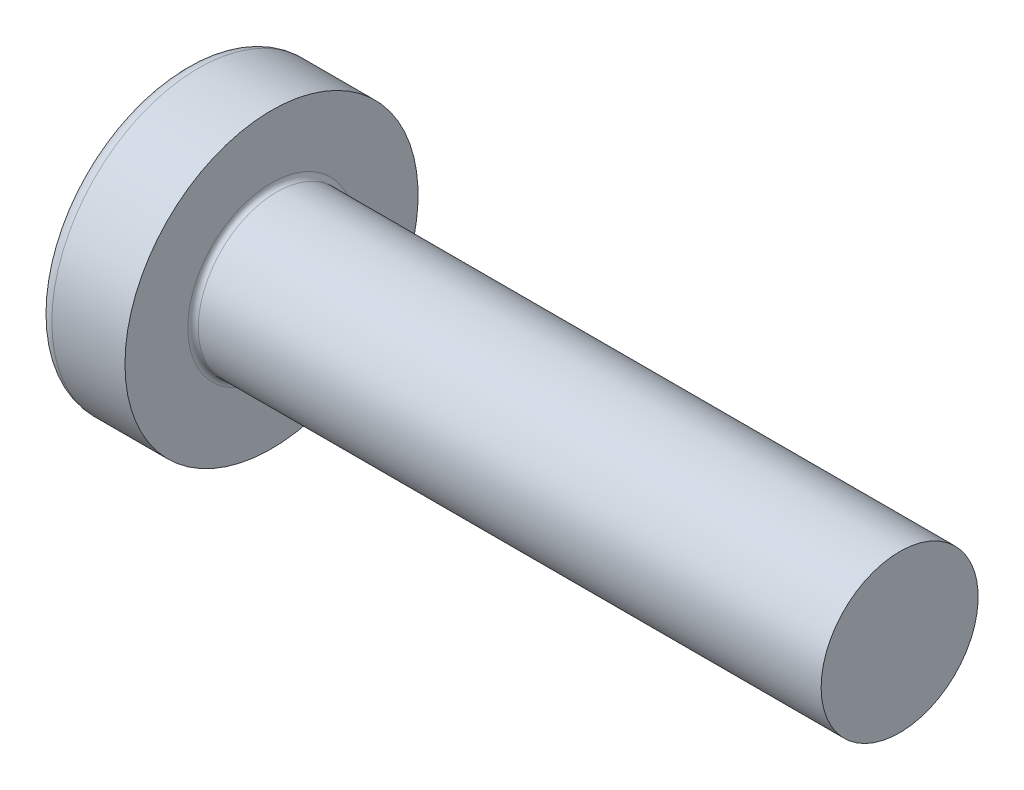
ISO-10303-21;
HEADER;
FILE_DESCRIPTION(('STEP AP214'),'2;1');
FILE_NAME('part.step','',(''),(''),'','','');
FILE_SCHEMA(('AUTOMOTIVE_DESIGN { 1 0 10303 214 1 1 1 1 }'));
ENDSEC;
DATA;
#1=APPLICATION_CONTEXT('core data for automotive mechanical design processes');
#2=APPLICATION_PROTOCOL_DEFINITION('international standard','automotive_design',2000,#1);
#3=PRODUCT_CONTEXT('',#1,'mechanical');
#4=PRODUCT('Part','Part','',(#3));
#5=PRODUCT_RELATED_PRODUCT_CATEGORY('part','',(#4));
#6=PRODUCT_DEFINITION_FORMATION('','',#4);
#7=PRODUCT_DEFINITION_CONTEXT('part definition',#1,'design');
#8=PRODUCT_DEFINITION('design','',#6,#7);
#9=PRODUCT_DEFINITION_SHAPE('','',#8);
#10=(LENGTH_UNIT() NAMED_UNIT(*) SI_UNIT(.MILLI.,.METRE.));
#11=(NAMED_UNIT(*) PLANE_ANGLE_UNIT() SI_UNIT($,.RADIAN.));
#12=(NAMED_UNIT(*) SI_UNIT($,.STERADIAN.) SOLID_ANGLE_UNIT());
#13=UNCERTAINTY_MEASURE_WITH_UNIT(LENGTH_MEASURE(1.E-05),#10,'distance_accuracy_value','');
#14=(GEOMETRIC_REPRESENTATION_CONTEXT(3) GLOBAL_UNCERTAINTY_ASSIGNED_CONTEXT((#13)) GLOBAL_UNIT_ASSIGNED_CONTEXT((#10,
#11,#12)) REPRESENTATION_CONTEXT('',''));
#15=CARTESIAN_POINT('',(0.,0.,0.));
#16=DIRECTION('',(0.,0.,1.));
#17=DIRECTION('',(1.,0.,0.));
#18=AXIS2_PLACEMENT_3D('',#15,#16,#17);
#19=CARTESIAN_POINT('',(5.,0.,0.));
#20=DIRECTION('',(-1.,0.,0.));
#21=DIRECTION('',(0.,1.,0.));
#22=AXIS2_PLACEMENT_3D('',#19,#20,#21);
#23=SPHERICAL_SURFACE('',#22,5.);
#24=CARTESIAN_POINT('',(0.775371598933733,0.,0.));
#25=DIRECTION('',(-1.,0.,0.));
#26=DIRECTION('',(0.,0.,1.));
#27=AXIS2_PLACEMENT_3D('',#24,#25,#26);
#28=CIRCLE('',#27,2.67441860465116);
#29=CARTESIAN_POINT('',(0.775371598933733,0.,2.67441860465116));
#30=VERTEX_POINT('',#29);
#31=EDGE_CURVE('E233',#30,#30,#28,.T.);
#32=ORIENTED_EDGE('',*,*,#31,.T.);
#33=EDGE_LOOP('',(#32));
#34=FACE_BOUND('',#33,.T.);
#35=CARTESIAN_POINT('',(0.0457951200896417,0.,0.));
#36=DIRECTION('',(1.,0.,0.));
#37=DIRECTION('',(0.,0.,-1.));
#38=AXIS2_PLACEMENT_3D('',#35,#36,#37);
#39=CIRCLE('',#38,0.675169614150692);
#40=CARTESIAN_POINT('',(0.0457951200896426,-0.369999999999998,-0.564760133040918));
#41=VERTEX_POINT('',#40);
#42=CARTESIAN_POINT('',(0.0457951200896417,-0.564760133040915,-0.37));
#43=VERTEX_POINT('',#42);
#44=EDGE_CURVE('E369',#41,#43,#39,.F.);
#45=ORIENTED_EDGE('',*,*,#44,.F.);
#46=CARTESIAN_POINT('',(5.,-0.37,0.));
#47=DIRECTION('',(0.,1.,0.));
#48=DIRECTION('',(0.,0.,1.));
#49=AXIS2_PLACEMENT_3D('',#46,#47,#48);
#50=CIRCLE('',#49,4.98629120689917);
#51=CARTESIAN_POINT('',(0.187869731256034,-0.369999999999995,-1.30633161051784));
#52=VERTEX_POINT('',#51);
#53=EDGE_CURVE('E295',#52,#41,#50,.T.);
#54=ORIENTED_EDGE('',*,*,#53,.F.);
#55=CARTESIAN_POINT('',(4.56358245832426,0.,0.875318202045668));
#56=DIRECTION('',(0.446197800778958,0.,-0.894934367749961));
#57=DIRECTION('',(-0.89493436774996,0.,-0.446197800778958));
#58=AXIS2_PLACEMENT_3D('',#55,#56,#57);
#59=CIRCLE('',#58,4.90340267309195);
#60=CARTESIAN_POINT('',(0.187869731256034,0.370000000000005,-1.30633161051784));
#61=VERTEX_POINT('',#60);
#62=EDGE_CURVE('E267',#52,#61,#59,.T.);
#63=ORIENTED_EDGE('',*,*,#62,.T.);
#64=CARTESIAN_POINT('',(5.,0.37,0.));
#65=DIRECTION('',(0.,-1.,0.));
#66=DIRECTION('',(0.,0.,-1.));
#67=AXIS2_PLACEMENT_3D('',#64,#65,#66);
#68=CIRCLE('',#67,4.98629120689917);
#69=CARTESIAN_POINT('',(0.0457951200896421,0.370000000000002,-0.564760133040916));
#70=VERTEX_POINT('',#69);
#71=EDGE_CURVE('E322',#70,#61,#68,.T.);
#72=ORIENTED_EDGE('',*,*,#71,.F.);
#73=CARTESIAN_POINT('',(0.0457951200896417,0.564760133040916,-0.37));
#74=VERTEX_POINT('',#73);
#75=EDGE_CURVE('E388',#74,#70,#39,.F.);
#76=ORIENTED_EDGE('',*,*,#75,.F.);
#77=CARTESIAN_POINT('',(5.,0.,-0.37));
#78=DIRECTION('',(0.,0.,1.));
#79=DIRECTION('',(1.,0.,0.));
#80=AXIS2_PLACEMENT_3D('',#77,#78,#79);
#81=CIRCLE('',#80,4.98629120689917);
#82=CARTESIAN_POINT('',(0.187869731256034,1.30633161051784,-0.37));
#83=VERTEX_POINT('',#82);
#84=EDGE_CURVE('E261',#83,#74,#81,.T.);
#85=ORIENTED_EDGE('',*,*,#84,.F.);
#86=CARTESIAN_POINT('',(4.56358245832426,-0.875318202045668,0.));
#87=DIRECTION('',(0.446197800778958,0.894934367749961,0.));
#88=DIRECTION('',(-0.89493436774996,0.446197800778958,0.));
#89=AXIS2_PLACEMENT_3D('',#86,#87,#88);
#90=CIRCLE('',#89,4.90340267309195);
#91=CARTESIAN_POINT('',(0.187869731256034,1.30633161051784,0.37));
#92=VERTEX_POINT('',#91);
#93=EDGE_CURVE('E264',#83,#92,#90,.T.);
#94=ORIENTED_EDGE('',*,*,#93,.T.);
#95=CARTESIAN_POINT('',(5.,0.,0.37));
#96=DIRECTION('',(0.,0.,-1.));
#97=DIRECTION('',(0.,1.,0.));
#98=AXIS2_PLACEMENT_3D('',#95,#96,#97);
#99=CIRCLE('',#98,4.98629120689917);
#100=CARTESIAN_POINT('',(0.0457951200896417,0.564760133040916,0.37));
#101=VERTEX_POINT('',#100);
#102=EDGE_CURVE('E257',#101,#92,#99,.T.);
#103=ORIENTED_EDGE('',*,*,#102,.F.);
#104=CARTESIAN_POINT('',(0.0457951200896426,0.369999999999998,0.564760133040918));
#105=VERTEX_POINT('',#104);
#106=EDGE_CURVE('E387',#105,#101,#39,.F.);
#107=ORIENTED_EDGE('',*,*,#106,.F.);
#108=CARTESIAN_POINT('',(0.187869731256034,0.369999999999995,1.30633161051784));
#109=VERTEX_POINT('',#108);
#110=EDGE_CURVE('E277',#109,#105,#68,.T.);
#111=ORIENTED_EDGE('',*,*,#110,.F.);
#112=CARTESIAN_POINT('',(4.56358245832426,0.,-0.875318202045669));
#113=DIRECTION('',(0.446197800778958,0.,0.894934367749961));
#114=DIRECTION('',(0.89493436774996,0.,-0.446197800778958));
#115=AXIS2_PLACEMENT_3D('',#112,#113,#114);
#116=CIRCLE('',#115,4.90340267309195);
#117=CARTESIAN_POINT('',(0.187869731256034,-0.370000000000005,1.30633161051784));
#118=VERTEX_POINT('',#117);
#119=EDGE_CURVE('E44',#109,#118,#116,.T.);
#120=ORIENTED_EDGE('',*,*,#119,.T.);
#121=CARTESIAN_POINT('',(0.0457951200896421,-0.370000000000002,0.564760133040916));
#122=VERTEX_POINT('',#121);
#123=EDGE_CURVE('E274',#122,#118,#50,.T.);
#124=ORIENTED_EDGE('',*,*,#123,.F.);
#125=CARTESIAN_POINT('',(0.0457951200896417,-0.564760133040916,0.37));
#126=VERTEX_POINT('',#125);
#127=EDGE_CURVE('E423',#126,#122,#39,.F.);
#128=ORIENTED_EDGE('',*,*,#127,.F.);
#129=CARTESIAN_POINT('',(0.187869731256034,-1.30633161051784,0.37));
#130=VERTEX_POINT('',#129);
#131=EDGE_CURVE('E258',#130,#126,#99,.T.);
#132=ORIENTED_EDGE('',*,*,#131,.F.);
#133=CARTESIAN_POINT('',(4.56358245832426,0.875318202045668,0.));
#134=DIRECTION('',(0.446197800778958,-0.894934367749961,0.));
#135=DIRECTION('',(0.89493436774996,0.446197800778958,0.));
#136=AXIS2_PLACEMENT_3D('',#133,#134,#135);
#137=CIRCLE('',#136,4.90340267309195);
#138=CARTESIAN_POINT('',(0.187869731256034,-1.30633161051784,-0.37));
#139=VERTEX_POINT('',#138);
#140=EDGE_CURVE('E254',#130,#139,#137,.T.);
#141=ORIENTED_EDGE('',*,*,#140,.T.);
#142=EDGE_CURVE('E59',#43,#139,#81,.T.);
#143=ORIENTED_EDGE('',*,*,#142,.F.);
#144=EDGE_LOOP('',(#45,#54,#63,#72,#76,#85,#94,#103,#107,#111,#120,#124,#128,#132,#141,#143));
#145=FACE_BOUND('',#144,.T.);
#146=ADVANCED_FACE('F31',(#34,#145),#23,.T.);
#147=CARTESIAN_POINT('',(1.75,0.527482216012805,-0.37));
#148=DIRECTION('',(0.,0.,1.));
#149=DIRECTION('',(1.,0.,0.));
#150=AXIS2_PLACEMENT_3D('',#147,#148,#149);
#151=PLANE('',#150);
#152=ORIENTED_EDGE('',*,*,#84,.T.);
#153=CARTESIAN_POINT('',(-0.987293237053716,0.649401255967161,-0.37));
#154=CARTESIAN_POINT('',(-0.781914975317084,0.632865887002871,-0.37));
#155=CARTESIAN_POINT('',(-0.576547882393372,0.616188977635081,-0.37));
#156=CARTESIAN_POINT('',(-0.165841599226327,0.582441031964227,-0.37));
#157=CARTESIAN_POINT('',(0.0394975903090452,0.56536998705488,-0.37));
#158=CARTESIAN_POINT('',(0.450133475422572,0.530723441326535,-0.37));
#159=CARTESIAN_POINT('',(0.655430171010573,0.513147940624557,-0.37));
#160=CARTESIAN_POINT('',(1.06596140177934,0.477314957985794,-0.37));
#161=CARTESIAN_POINT('',(1.2711959378071,0.459057485806066,-0.37));
#162=CARTESIAN_POINT('',(1.61065292365626,0.428051938688768,-0.37));
#163=CARTESIAN_POINT('',(1.74490059995643,0.415580824990931,-0.37));
#164=CARTESIAN_POINT('',(2.01334321762763,0.390092023404979,-0.37));
#165=CARTESIAN_POINT('',(2.14753815934577,0.377074339177353,-0.37));
#166=CARTESIAN_POINT('',(2.41586354151957,0.350315629452843,-0.37));
#167=CARTESIAN_POINT('',(2.5499939784531,0.33657456817765,-0.37));
#168=CARTESIAN_POINT('',(2.81814173295471,0.308004077741875,-0.37));
#169=CARTESIAN_POINT('',(2.95215904765134,0.293174621747065,-0.37));
#170=CARTESIAN_POINT('',(3.0860955068368,0.277618485071816,-0.37));
#171=B_SPLINE_CURVE_WITH_KNOTS('',3,(#153,#154,#155,#156,#157,#158,#159,#160,#161,#162,#163,
#164,#165,#166,#167,#168,#169,#170),.UNSPECIFIED.,.F.,.F.,(4,2,2,2,2,2,2,2,4),(0.,
0.618128793984691,1.23627109812525,1.85441325887562,2.4725465791681,2.87702276218609,
3.28149623678161,3.68598973550942,4.09049321032311),.UNSPECIFIED.);
#172=CARTESIAN_POINT('',(1.75,0.415013252800437,-0.37));
#173=VERTEX_POINT('',#172);
#174=EDGE_CURVE('E409',#74,#173,#171,.T.);
#175=ORIENTED_EDGE('',*,*,#174,.T.);
#176=DIRECTION('',(0.,1.,0.));
#177=VECTOR('',#176,1.);
#178=CARTESIAN_POINT('',(1.75,-0.527482216012805,-0.37));
#179=LINE('',#178,#177);
#180=CARTESIAN_POINT('',(1.75,0.527482216012805,-0.37));
#181=VERTEX_POINT('',#180);
#182=EDGE_CURVE('E351',#173,#181,#179,.T.);
#183=ORIENTED_EDGE('',*,*,#182,.T.);
#184=DIRECTION('',(0.89493436774996,-0.446197800778958,0.));
#185=VECTOR('',#184,1.);
#186=CARTESIAN_POINT('',(0.,1.4,-0.37));
#187=LINE('',#186,#185);
#188=EDGE_CURVE('E234',#83,#181,#187,.T.);
#189=ORIENTED_EDGE('',*,*,#188,.F.);
#190=EDGE_LOOP('',(#152,#175,#183,#189));
#191=FACE_BOUND('',#190,.T.);
#192=ADVANCED_FACE('F189',(#191),#151,.T.);
#193=CARTESIAN_POINT('',(1.75,-0.527482216012805,-0.37));
#194=VERTEX_POINT('',#193);
#195=CARTESIAN_POINT('',(1.75,-0.415013252800437,-0.37));
#196=VERTEX_POINT('',#195);
#197=EDGE_CURVE('E242',#194,#196,#179,.T.);
#198=ORIENTED_EDGE('',*,*,#197,.T.);
#199=CARTESIAN_POINT('',(-0.987293237053716,-0.649401255967161,-0.37));
#200=CARTESIAN_POINT('',(-0.781914975317084,-0.632865887002871,-0.37));
#201=CARTESIAN_POINT('',(-0.576547882393372,-0.616188977635081,-0.37));
#202=CARTESIAN_POINT('',(-0.165841599226327,-0.582441031964227,-0.37));
#203=CARTESIAN_POINT('',(0.0394975903090452,-0.56536998705488,-0.37));
#204=CARTESIAN_POINT('',(0.450133475422572,-0.530723441326535,-0.37));
#205=CARTESIAN_POINT('',(0.655430171010573,-0.513147940624557,-0.37));
#206=CARTESIAN_POINT('',(1.06596140177934,-0.477314957985794,-0.37));
#207=CARTESIAN_POINT('',(1.2711959378071,-0.459057485806066,-0.37));
#208=CARTESIAN_POINT('',(1.61065292365626,-0.428051938688768,-0.37));
#209=CARTESIAN_POINT('',(1.74490059995643,-0.415580824990931,-0.37));
#210=CARTESIAN_POINT('',(2.01334321762763,-0.390092023404979,-0.37));
#211=CARTESIAN_POINT('',(2.14753815934577,-0.377074339177353,-0.37));
#212=CARTESIAN_POINT('',(2.41586354151957,-0.350315629452843,-0.37));
#213=CARTESIAN_POINT('',(2.5499939784531,-0.33657456817765,-0.37));
#214=CARTESIAN_POINT('',(2.81814173295471,-0.308004077741875,-0.37));
#215=CARTESIAN_POINT('',(2.95215904765134,-0.293174621747065,-0.37));
#216=CARTESIAN_POINT('',(3.0860955068368,-0.277618485071816,-0.37));
#217=B_SPLINE_CURVE_WITH_KNOTS('',3,(#199,#200,#201,#202,#203,#204,#205,#206,#207,#208,#209,
#210,#211,#212,#213,#214,#215,#216),.UNSPECIFIED.,.F.,.F.,(4,2,2,2,2,2,2,2,4),(0.,
0.618128793984691,1.23627109812525,1.85441325887562,2.4725465791681,2.87702276218609,
3.28149623678161,3.68598973550942,4.09049321032311),.UNSPECIFIED.);
#218=EDGE_CURVE('E386',#196,#43,#217,.F.);
#219=ORIENTED_EDGE('',*,*,#218,.T.);
#220=ORIENTED_EDGE('',*,*,#142,.T.);
#221=DIRECTION('',(0.89493436774996,0.446197800778958,0.));
#222=VECTOR('',#221,1.);
#223=CARTESIAN_POINT('',(0.,-1.4,-0.37));
#224=LINE('',#223,#222);
#225=EDGE_CURVE('E325',#139,#194,#224,.T.);
#226=ORIENTED_EDGE('',*,*,#225,.T.);
#227=EDGE_LOOP('',(#198,#219,#220,#226));
#228=FACE_BOUND('',#227,.T.);
#229=ADVANCED_FACE('F195',(#228),#151,.T.);
#230=CARTESIAN_POINT('',(1.75,-0.527482216012805,0.37));
#231=DIRECTION('',(0.,0.,-1.));
#232=DIRECTION('',(0.,1.,0.));
#233=AXIS2_PLACEMENT_3D('',#230,#231,#232);
#234=PLANE('',#233);
#235=DIRECTION('',(0.,-1.,0.));
#236=VECTOR('',#235,1.);
#237=CARTESIAN_POINT('',(1.75,0.527482216012805,0.37));
#238=LINE('',#237,#236);
#239=CARTESIAN_POINT('',(1.75,0.527482216012805,0.37));
#240=VERTEX_POINT('',#239);
#241=CARTESIAN_POINT('',(1.75,0.415013252800437,0.37));
#242=VERTEX_POINT('',#241);
#243=EDGE_CURVE('E334',#240,#242,#238,.T.);
#244=ORIENTED_EDGE('',*,*,#243,.T.);
#245=CARTESIAN_POINT('',(-0.987293237069635,0.649401255968442,0.37));
#246=CARTESIAN_POINT('',(-0.781914975331301,0.632865887004023,0.37));
#247=CARTESIAN_POINT('',(-0.576547882405888,0.616188977636102,0.37));
#248=CARTESIAN_POINT('',(-0.16584159923544,0.582441031964983,0.37));
#249=CARTESIAN_POINT('',(0.0394975903016338,0.5653699870555,0.37));
#250=CARTESIAN_POINT('',(0.450133475420601,0.530723441326706,0.37));
#251=CARTESIAN_POINT('',(0.655430171012341,0.513147940624409,0.37));
#252=CARTESIAN_POINT('',(1.06596140178858,0.477314957984981,0.37));
#253=CARTESIAN_POINT('',(1.27119593782008,0.459057485804908,0.37));
#254=CARTESIAN_POINT('',(1.61065292367297,0.428051938687225,0.37));
#255=CARTESIAN_POINT('',(1.74490059997313,0.415580824989367,0.37));
#256=CARTESIAN_POINT('',(2.01334321764434,0.39009202340337,0.37));
#257=CARTESIAN_POINT('',(2.14753815936247,0.377074339175718,0.37));
#258=CARTESIAN_POINT('',(2.41586354153627,0.350315629451146,0.37));
#259=CARTESIAN_POINT('',(2.54999397846979,0.336574568175918,0.37));
#260=CARTESIAN_POINT('',(2.8181417329714,0.308004077740054,0.37));
#261=CARTESIAN_POINT('',(2.95215904766802,0.29317462174519,0.37));
#262=CARTESIAN_POINT('',(3.08609550685347,0.277618485069873,0.37));
#263=B_SPLINE_CURVE_WITH_KNOTS('',3,(#245,#246,#247,#248,#249,#250,#251,#252,#253,#254,#255,
#256,#257,#258,#259,#260,#261,#262),.UNSPECIFIED.,.F.,.F.,(4,2,2,2,2,2,2,2,4),(0.,
0.61812879398981,1.23627109813549,1.85441325889711,2.47254657920086,2.87702276221884,
3.28149623681436,3.68598973554218,4.09049321035586),.UNSPECIFIED.);
#264=EDGE_CURVE('E659',#242,#101,#263,.F.);
#265=ORIENTED_EDGE('',*,*,#264,.T.);
#266=ORIENTED_EDGE('',*,*,#102,.T.);
#267=DIRECTION('',(0.89493436774996,-0.446197800778958,0.));
#268=VECTOR('',#267,1.);
#269=CARTESIAN_POINT('',(0.,1.4,0.37));
#270=LINE('',#269,#268);
#271=EDGE_CURVE('E239',#92,#240,#270,.T.);
#272=ORIENTED_EDGE('',*,*,#271,.T.);
#273=EDGE_LOOP('',(#244,#265,#266,#272));
#274=FACE_BOUND('',#273,.T.);
#275=ADVANCED_FACE('F405',(#274),#234,.T.);
#276=ORIENTED_EDGE('',*,*,#131,.T.);
#277=CARTESIAN_POINT('',(-0.987293237069635,-0.649401255968442,0.37));
#278=CARTESIAN_POINT('',(-0.781914975331301,-0.632865887004023,0.37));
#279=CARTESIAN_POINT('',(-0.576547882405888,-0.616188977636102,0.37));
#280=CARTESIAN_POINT('',(-0.16584159923544,-0.582441031964983,0.37));
#281=CARTESIAN_POINT('',(0.0394975903016338,-0.5653699870555,0.37));
#282=CARTESIAN_POINT('',(0.450133475420601,-0.530723441326706,0.37));
#283=CARTESIAN_POINT('',(0.655430171012341,-0.513147940624409,0.37));
#284=CARTESIAN_POINT('',(1.06596140178858,-0.477314957984981,0.37));
#285=CARTESIAN_POINT('',(1.27119593782008,-0.459057485804908,0.37));
#286=CARTESIAN_POINT('',(1.61065292367297,-0.428051938687225,0.37));
#287=CARTESIAN_POINT('',(1.74490059997313,-0.415580824989367,0.37));
#288=CARTESIAN_POINT('',(2.01334321764434,-0.390092023403371,0.37));
#289=CARTESIAN_POINT('',(2.14753815936247,-0.377074339175718,0.37));
#290=CARTESIAN_POINT('',(2.41586354153627,-0.350315629451146,0.37));
#291=CARTESIAN_POINT('',(2.54999397846979,-0.336574568175918,0.37));
#292=CARTESIAN_POINT('',(2.8181417329714,-0.308004077740054,0.37));
#293=CARTESIAN_POINT('',(2.95215904766802,-0.29317462174519,0.37));
#294=CARTESIAN_POINT('',(3.08609550685347,-0.277618485069873,0.37));
#295=B_SPLINE_CURVE_WITH_KNOTS('',3,(#277,#278,#279,#280,#281,#282,#283,#284,#285,#286,#287,
#288,#289,#290,#291,#292,#293,#294),.UNSPECIFIED.,.F.,.F.,(4,2,2,2,2,2,2,2,4),(0.,
0.61812879398981,1.23627109813549,1.85441325889711,2.47254657920086,2.87702276221884,
3.28149623681436,3.68598973554218,4.09049321035586),.UNSPECIFIED.);
#296=CARTESIAN_POINT('',(1.75,-0.415013252800437,0.37));
#297=VERTEX_POINT('',#296);
#298=EDGE_CURVE('E424',#126,#297,#295,.T.);
#299=ORIENTED_EDGE('',*,*,#298,.T.);
#300=CARTESIAN_POINT('',(1.75,-0.527482216012805,0.37));
#301=VERTEX_POINT('',#300);
#302=EDGE_CURVE('E336',#297,#301,#238,.T.);
#303=ORIENTED_EDGE('',*,*,#302,.T.);
#304=DIRECTION('',(0.89493436774996,0.446197800778958,0.));
#305=VECTOR('',#304,1.);
#306=CARTESIAN_POINT('',(0.,-1.4,0.37));
#307=LINE('',#306,#305);
#308=EDGE_CURVE('E327',#130,#301,#307,.T.);
#309=ORIENTED_EDGE('',*,*,#308,.F.);
#310=EDGE_LOOP('',(#276,#299,#303,#309));
#311=FACE_BOUND('',#310,.T.);
#312=ADVANCED_FACE('F515',(#311),#234,.T.);
#313=CARTESIAN_POINT('',(1.75,0.527482216012805,0.37));
#314=DIRECTION('',(0.446197800778958,0.894934367749961,0.));
#315=DIRECTION('',(-0.89493436774996,0.446197800778958,0.));
#316=AXIS2_PLACEMENT_3D('',#313,#314,#315);
#317=PLANE('',#316);
#318=CARTESIAN_POINT('',(2.66965234556629,0.0689604865315897,0.));
#319=DIRECTION('',(0.446197800778958,0.894934367749961,0.));
#320=DIRECTION('',(-0.89493436774996,0.446197800778958,0.));
#321=AXIS2_PLACEMENT_3D('',#318,#319,#320);
#322=ELLIPSE('',#321,1.10195891266117,0.486831719863514);
#323=CARTESIAN_POINT('',(1.75,0.527482216012806,0.175779725196678));
#324=VERTEX_POINT('',#323);
#325=CARTESIAN_POINT('',(1.75,0.527482216012806,-0.175779725196678));
#326=VERTEX_POINT('',#325);
#327=EDGE_CURVE('E300',#324,#326,#322,.F.);
#328=ORIENTED_EDGE('',*,*,#327,.F.);
#329=DIRECTION('',(0.,0.,-1.));
#330=VECTOR('',#329,1.);
#331=CARTESIAN_POINT('',(1.75,0.527482216012805,0.37));
#332=LINE('',#331,#330);
#333=EDGE_CURVE('E337',#240,#324,#332,.T.);
#334=ORIENTED_EDGE('',*,*,#333,.F.);
#335=ORIENTED_EDGE('',*,*,#271,.F.);
#336=ORIENTED_EDGE('',*,*,#93,.F.);
#337=ORIENTED_EDGE('',*,*,#188,.T.);
#338=EDGE_CURVE('E339',#326,#181,#332,.T.);
#339=ORIENTED_EDGE('',*,*,#338,.F.);
#340=EDGE_LOOP('',(#328,#334,#335,#336,#337,#339));
#341=FACE_BOUND('',#340,.T.);
#342=ADVANCED_FACE('F403',(#341),#317,.F.);
#343=CARTESIAN_POINT('',(0.,-1.4,-0.37));
#344=DIRECTION('',(0.446197800778958,-0.894934367749961,0.));
#345=DIRECTION('',(0.89493436774996,0.446197800778958,0.));
#346=AXIS2_PLACEMENT_3D('',#343,#344,#345);
#347=PLANE('',#346);
#348=CARTESIAN_POINT('',(2.66965234556629,-0.0689604865315897,0.));
#349=DIRECTION('',(0.446197800778958,-0.894934367749961,0.));
#350=DIRECTION('',(-0.89493436774996,-0.446197800778958,0.));
#351=AXIS2_PLACEMENT_3D('',#348,#349,#350);
#352=ELLIPSE('',#351,1.10195891266117,0.486831719863514);
#353=CARTESIAN_POINT('',(1.75,-0.527482216012806,-0.175779725196678));
#354=VERTEX_POINT('',#353);
#355=CARTESIAN_POINT('',(1.75,-0.527482216012806,0.175779725196678));
#356=VERTEX_POINT('',#355);
#357=EDGE_CURVE('E661',#354,#356,#352,.F.);
#358=ORIENTED_EDGE('',*,*,#357,.F.);
#359=DIRECTION('',(0.,0.,1.));
#360=VECTOR('',#359,1.);
#361=CARTESIAN_POINT('',(1.75,-0.527482216012805,-0.37));
#362=LINE('',#361,#360);
#363=EDGE_CURVE('E330',#194,#354,#362,.T.);
#364=ORIENTED_EDGE('',*,*,#363,.F.);
#365=ORIENTED_EDGE('',*,*,#225,.F.);
#366=ORIENTED_EDGE('',*,*,#140,.F.);
#367=ORIENTED_EDGE('',*,*,#308,.T.);
#368=EDGE_CURVE('E333',#356,#301,#362,.T.);
#369=ORIENTED_EDGE('',*,*,#368,.F.);
#370=EDGE_LOOP('',(#358,#364,#365,#366,#367,#369));
#371=FACE_BOUND('',#370,.T.);
#372=ADVANCED_FACE('F502',(#371),#347,.F.);
#373=CARTESIAN_POINT('',(1.75,0.527482216012805,-0.37));
#374=DIRECTION('',(-1.,0.,0.));
#375=DIRECTION('',(0.,0.,1.));
#376=AXIS2_PLACEMENT_3D('',#373,#374,#375);
#377=PLANE('',#376);
#378=DIRECTION('',(0.,1.,0.));
#379=VECTOR('',#378,1.);
#380=CARTESIAN_POINT('',(1.75,-0.370000000000002,0.527482216012804));
#381=LINE('',#380,#379);
#382=CARTESIAN_POINT('',(1.75,-0.370000000000002,0.527482216012804));
#383=VERTEX_POINT('',#382);
#384=CARTESIAN_POINT('',(1.75,-0.175779725196681,0.527482216012805));
#385=VERTEX_POINT('',#384);
#386=EDGE_CURVE('E315',#383,#385,#381,.T.);
#387=ORIENTED_EDGE('',*,*,#386,.T.);
#388=CARTESIAN_POINT('',(1.75,0.,0.));
#389=DIRECTION('',(-1.,0.,0.));
#390=DIRECTION('',(0.,0.,1.));
#391=AXIS2_PLACEMENT_3D('',#388,#389,#390);
#392=CIRCLE('',#391,0.556);
#393=CARTESIAN_POINT('',(1.75,-0.370000000000001,0.415013252800436));
#394=VERTEX_POINT('',#393);
#395=EDGE_CURVE('E687',#394,#385,#392,.T.);
#396=ORIENTED_EDGE('',*,*,#395,.F.);
#397=DIRECTION('',(0.,0.,-1.));
#398=VECTOR('',#397,1.);
#399=CARTESIAN_POINT('',(1.75,-0.370000000000002,0.527482216012804));
#400=LINE('',#399,#398);
#401=EDGE_CURVE('E311',#383,#394,#400,.T.);
#402=ORIENTED_EDGE('',*,*,#401,.F.);
#403=EDGE_LOOP('',(#387,#396,#402));
#404=FACE_BOUND('',#403,.T.);
#405=ADVANCED_FACE('F459',(#404),#377,.T.);
#406=ORIENTED_EDGE('',*,*,#302,.F.);
#407=EDGE_CURVE('E692',#356,#297,#392,.T.);
#408=ORIENTED_EDGE('',*,*,#407,.F.);
#409=ORIENTED_EDGE('',*,*,#368,.T.);
#410=EDGE_LOOP('',(#406,#408,#409));
#411=FACE_BOUND('',#410,.T.);
#412=ADVANCED_FACE('F489',(#411),#377,.T.);
#413=ORIENTED_EDGE('',*,*,#363,.T.);
#414=EDGE_CURVE('E380',#196,#354,#392,.T.);
#415=ORIENTED_EDGE('',*,*,#414,.F.);
#416=ORIENTED_EDGE('',*,*,#197,.F.);
#417=EDGE_LOOP('',(#413,#415,#416));
#418=FACE_BOUND('',#417,.T.);
#419=ADVANCED_FACE('F483',(#418),#377,.T.);
#420=CARTESIAN_POINT('',(1.75,-0.369999999999998,-0.415013252800438));
#421=VERTEX_POINT('',#420);
#422=CARTESIAN_POINT('',(1.75,-0.369999999999998,-0.527482216012807));
#423=VERTEX_POINT('',#422);
#424=EDGE_CURVE('E314',#421,#423,#400,.T.);
#425=ORIENTED_EDGE('',*,*,#424,.F.);
#426=CARTESIAN_POINT('',(1.75,-0.175779725196678,-0.527482216012806));
#427=VERTEX_POINT('',#426);
#428=EDGE_CURVE('E51',#427,#421,#392,.T.);
#429=ORIENTED_EDGE('',*,*,#428,.F.);
#430=DIRECTION('',(0.,-1.,0.));
#431=VECTOR('',#430,1.);
#432=CARTESIAN_POINT('',(1.75,0.370000000000002,-0.527482216012804));
#433=LINE('',#432,#431);
#434=EDGE_CURVE('E310',#427,#423,#433,.T.);
#435=ORIENTED_EDGE('',*,*,#434,.T.);
#436=EDGE_LOOP('',(#425,#429,#435));
#437=FACE_BOUND('',#436,.T.);
#438=ADVANCED_FACE('F375',(#437),#377,.T.);
#439=CARTESIAN_POINT('',(1.75,0.370000000000002,-0.527482216012804));
#440=VERTEX_POINT('',#439);
#441=CARTESIAN_POINT('',(1.75,0.175779725196682,-0.527482216012805));
#442=VERTEX_POINT('',#441);
#443=EDGE_CURVE('E307',#440,#442,#433,.T.);
#444=ORIENTED_EDGE('',*,*,#443,.T.);
#445=CARTESIAN_POINT('',(1.75,0.370000000000001,-0.415013252800436));
#446=VERTEX_POINT('',#445);
#447=EDGE_CURVE('E379',#446,#442,#392,.T.);
#448=ORIENTED_EDGE('',*,*,#447,.F.);
#449=DIRECTION('',(0.,0.,1.));
#450=VECTOR('',#449,1.);
#451=CARTESIAN_POINT('',(1.75,0.370000000000002,-0.527482216012804));
#452=LINE('',#451,#450);
#453=EDGE_CURVE('E319',#440,#446,#452,.T.);
#454=ORIENTED_EDGE('',*,*,#453,.F.);
#455=EDGE_LOOP('',(#444,#448,#454));
#456=FACE_BOUND('',#455,.T.);
#457=ADVANCED_FACE('F471',(#456),#377,.T.);
#458=ORIENTED_EDGE('',*,*,#182,.F.);
#459=EDGE_CURVE('E676',#326,#173,#392,.T.);
#460=ORIENTED_EDGE('',*,*,#459,.F.);
#461=ORIENTED_EDGE('',*,*,#338,.T.);
#462=EDGE_LOOP('',(#458,#460,#461));
#463=FACE_BOUND('',#462,.T.);
#464=ADVANCED_FACE('F465',(#463),#377,.T.);
#465=ORIENTED_EDGE('',*,*,#333,.T.);
#466=EDGE_CURVE('E678',#242,#324,#392,.T.);
#467=ORIENTED_EDGE('',*,*,#466,.F.);
#468=ORIENTED_EDGE('',*,*,#243,.F.);
#469=EDGE_LOOP('',(#465,#467,#468));
#470=FACE_BOUND('',#469,.T.);
#471=ADVANCED_FACE('F457',(#470),#377,.T.);
#472=CARTESIAN_POINT('',(1.75,0.369999999999999,0.415013252800439));
#473=VERTEX_POINT('',#472);
#474=CARTESIAN_POINT('',(1.75,0.369999999999998,0.527482216012807));
#475=VERTEX_POINT('',#474);
#476=EDGE_CURVE('E292',#473,#475,#452,.T.);
#477=ORIENTED_EDGE('',*,*,#476,.F.);
#478=CARTESIAN_POINT('',(1.75,0.175779725196678,0.527482216012806));
#479=VERTEX_POINT('',#478);
#480=EDGE_CURVE('E381',#479,#473,#392,.T.);
#481=ORIENTED_EDGE('',*,*,#480,.F.);
#482=EDGE_CURVE('E318',#479,#475,#381,.T.);
#483=ORIENTED_EDGE('',*,*,#482,.T.);
#484=EDGE_LOOP('',(#477,#481,#483));
#485=FACE_BOUND('',#484,.T.);
#486=ADVANCED_FACE('F451',(#485),#377,.T.);
#487=CARTESIAN_POINT('',(1.75,0.369999999999998,0.527482216012806));
#488=DIRECTION('',(0.,-1.,0.));
#489=DIRECTION('',(1.,0.,0.));
#490=AXIS2_PLACEMENT_3D('',#487,#488,#489);
#491=PLANE('',#490);
#492=ORIENTED_EDGE('',*,*,#110,.T.);
#493=CARTESIAN_POINT('',(-0.987293237069635,0.369999999999998,0.649401255968443));
#494=CARTESIAN_POINT('',(-0.781914975331301,0.369999999999998,0.632865887004024));
#495=CARTESIAN_POINT('',(-0.576547882405888,0.369999999999998,0.616188977636103));
#496=CARTESIAN_POINT('',(-0.16584159923544,0.369999999999998,0.582441031964984));
#497=CARTESIAN_POINT('',(0.0394975903016338,0.369999999999998,0.565369987055501));
#498=CARTESIAN_POINT('',(0.450133475420601,0.369999999999998,0.530723441326707));
#499=CARTESIAN_POINT('',(0.655430171012341,0.369999999999998,0.51314794062441));
#500=CARTESIAN_POINT('',(1.06596140178858,0.369999999999998,0.477314957984982));
#501=CARTESIAN_POINT('',(1.27119593782008,0.369999999999998,0.459057485804909));
#502=CARTESIAN_POINT('',(1.61065292367297,0.369999999999999,0.428051938687226));
#503=CARTESIAN_POINT('',(1.74490059997313,0.369999999999999,0.415580824989369));
#504=CARTESIAN_POINT('',(2.01334321764434,0.369999999999999,0.390092023403372));
#505=CARTESIAN_POINT('',(2.14753815936247,0.369999999999999,0.37707433917572));
#506=CARTESIAN_POINT('',(2.41586354153627,0.369999999999999,0.350315629451147));
#507=CARTESIAN_POINT('',(2.54999397846979,0.369999999999999,0.336574568175919));
#508=CARTESIAN_POINT('',(2.8181417329714,0.369999999999999,0.308004077740055));
#509=CARTESIAN_POINT('',(2.95215904766802,0.369999999999999,0.293174621745191));
#510=CARTESIAN_POINT('',(3.08609550685347,0.369999999999999,0.277618485069875));
#511=B_SPLINE_CURVE_WITH_KNOTS('',3,(#493,#494,#495,#496,#497,#498,#499,#500,#501,#502,#503,
#504,#505,#506,#507,#508,#509,#510),.UNSPECIFIED.,.F.,.F.,(4,2,2,2,2,2,2,2,4),(0.,
0.61812879398981,1.23627109813549,1.85441325889711,2.47254657920086,2.87702276221884,
3.28149623681436,3.68598973554218,4.09049321035586),.UNSPECIFIED.);
#512=EDGE_CURVE('E658',#105,#473,#511,.T.);
#513=ORIENTED_EDGE('',*,*,#512,.T.);
#514=ORIENTED_EDGE('',*,*,#476,.T.);
#515=DIRECTION('',(0.89493436774996,0.,-0.446197800778958));
#516=VECTOR('',#515,1.);
#517=CARTESIAN_POINT('',(0.,0.369999999999995,1.4));
#518=LINE('',#517,#516);
#519=EDGE_CURVE('E285',#109,#475,#518,.T.);
#520=ORIENTED_EDGE('',*,*,#519,.F.);
#521=EDGE_LOOP('',(#492,#513,#514,#520));
#522=FACE_BOUND('',#521,.T.);
#523=ADVANCED_FACE('F289',(#522),#491,.T.);
#524=CARTESIAN_POINT('',(1.75,-0.369999999999998,-0.527482216012807));
#525=DIRECTION('',(0.,1.,0.));
#526=DIRECTION('',(0.,0.,1.));
#527=AXIS2_PLACEMENT_3D('',#524,#525,#526);
#528=PLANE('',#527);
#529=ORIENTED_EDGE('',*,*,#401,.T.);
#530=CARTESIAN_POINT('',(-0.987293237053716,-0.370000000000002,0.649401255967159));
#531=CARTESIAN_POINT('',(-0.781914975317084,-0.370000000000002,0.63286588700287));
#532=CARTESIAN_POINT('',(-0.576547882393372,-0.370000000000002,0.616188977635079));
#533=CARTESIAN_POINT('',(-0.165841599226327,-0.370000000000002,0.582441031964225));
#534=CARTESIAN_POINT('',(0.039497590309045,-0.370000000000002,0.565369987054878));
#535=CARTESIAN_POINT('',(0.450133475422572,-0.370000000000002,0.530723441326534));
#536=CARTESIAN_POINT('',(0.655430171010573,-0.370000000000002,0.513147940624556));
#537=CARTESIAN_POINT('',(1.06596140177934,-0.370000000000002,0.477314957985792));
#538=CARTESIAN_POINT('',(1.2711959378071,-0.370000000000002,0.459057485806065));
#539=CARTESIAN_POINT('',(1.61065292365626,-0.370000000000001,0.428051938688767));
#540=CARTESIAN_POINT('',(1.74490059995642,-0.370000000000001,0.41558082499093));
#541=CARTESIAN_POINT('',(2.01334321762763,-0.370000000000001,0.390092023404978));
#542=CARTESIAN_POINT('',(2.14753815934577,-0.370000000000001,0.377074339177352));
#543=CARTESIAN_POINT('',(2.41586354151957,-0.370000000000001,0.350315629452841));
#544=CARTESIAN_POINT('',(2.5499939784531,-0.370000000000001,0.336574568177649));
#545=CARTESIAN_POINT('',(2.81814173295471,-0.370000000000001,0.308004077741874));
#546=CARTESIAN_POINT('',(2.95215904765134,-0.370000000000001,0.293174621747064));
#547=CARTESIAN_POINT('',(3.0860955068368,-0.370000000000001,0.277618485071814));
#548=B_SPLINE_CURVE_WITH_KNOTS('',3,(#530,#531,#532,#533,#534,#535,#536,#537,#538,#539,#540,
#541,#542,#543,#544,#545,#546,#547),.UNSPECIFIED.,.F.,.F.,(4,2,2,2,2,2,2,2,4),(0.,
0.618128793984691,1.23627109812525,1.85441325887562,2.4725465791681,2.87702276218609,
3.28149623678161,3.68598973550942,4.09049321032311),.UNSPECIFIED.);
#549=EDGE_CURVE('E417',#394,#122,#548,.F.);
#550=ORIENTED_EDGE('',*,*,#549,.T.);
#551=ORIENTED_EDGE('',*,*,#123,.T.);
#552=DIRECTION('',(0.89493436774996,0.,-0.446197800778958));
#553=VECTOR('',#552,1.);
#554=CARTESIAN_POINT('',(0.,-0.370000000000005,1.4));
#555=LINE('',#554,#553);
#556=EDGE_CURVE('E287',#118,#383,#555,.T.);
#557=ORIENTED_EDGE('',*,*,#556,.T.);
#558=EDGE_LOOP('',(#529,#550,#551,#557));
#559=FACE_BOUND('',#558,.T.);
#560=ADVANCED_FACE('F224',(#559),#528,.T.);
#561=CARTESIAN_POINT('',(1.75,-0.370000000000002,0.527482216012804));
#562=DIRECTION('',(0.446197800778958,0.,0.894934367749961));
#563=DIRECTION('',(-0.89493436774996,0.,0.446197800778958));
#564=AXIS2_PLACEMENT_3D('',#561,#562,#563);
#565=PLANE('',#564);
#566=CARTESIAN_POINT('',(2.66965234556629,0.,0.0689604865315897));
#567=DIRECTION('',(0.446197800778958,0.,0.894934367749961));
#568=DIRECTION('',(-0.89493436774996,0.,0.446197800778958));
#569=AXIS2_PLACEMENT_3D('',#566,#567,#568);
#570=ELLIPSE('',#569,1.10195891266117,0.486831719863514);
#571=EDGE_CURVE('E415',#385,#479,#570,.F.);
#572=ORIENTED_EDGE('',*,*,#571,.F.);
#573=ORIENTED_EDGE('',*,*,#386,.F.);
#574=ORIENTED_EDGE('',*,*,#556,.F.);
#575=ORIENTED_EDGE('',*,*,#119,.F.);
#576=ORIENTED_EDGE('',*,*,#519,.T.);
#577=ORIENTED_EDGE('',*,*,#482,.F.);
#578=EDGE_LOOP('',(#572,#573,#574,#575,#576,#577));
#579=FACE_BOUND('',#578,.T.);
#580=ADVANCED_FACE('F283',(#579),#565,.F.);
#581=CARTESIAN_POINT('',(0.,0.370000000000005,-1.4));
#582=DIRECTION('',(0.446197800778958,0.,-0.894934367749961));
#583=DIRECTION('',(0.89493436774996,0.,0.446197800778958));
#584=AXIS2_PLACEMENT_3D('',#581,#582,#583);
#585=PLANE('',#584);
#586=CARTESIAN_POINT('',(2.66965234556629,0.,-0.0689604865315896));
#587=DIRECTION('',(0.446197800778958,0.,-0.894934367749961));
#588=DIRECTION('',(-0.89493436774996,0.,-0.446197800778958));
#589=AXIS2_PLACEMENT_3D('',#586,#587,#588);
#590=ELLIPSE('',#589,1.10195891266117,0.486831719863514);
#591=EDGE_CURVE('E373',#442,#427,#590,.F.);
#592=ORIENTED_EDGE('',*,*,#591,.F.);
#593=ORIENTED_EDGE('',*,*,#443,.F.);
#594=DIRECTION('',(0.89493436774996,0.,0.446197800778958));
#595=VECTOR('',#594,1.);
#596=CARTESIAN_POINT('',(0.,0.370000000000005,-1.4));
#597=LINE('',#596,#595);
#598=EDGE_CURVE('E297',#61,#440,#597,.T.);
#599=ORIENTED_EDGE('',*,*,#598,.F.);
#600=ORIENTED_EDGE('',*,*,#62,.F.);
#601=DIRECTION('',(0.89493436774996,0.,0.446197800778958));
#602=VECTOR('',#601,1.);
#603=CARTESIAN_POINT('',(0.,-0.369999999999995,-1.4));
#604=LINE('',#603,#602);
#605=EDGE_CURVE('E304',#52,#423,#604,.T.);
#606=ORIENTED_EDGE('',*,*,#605,.T.);
#607=ORIENTED_EDGE('',*,*,#434,.F.);
#608=EDGE_LOOP('',(#592,#593,#599,#600,#606,#607));
#609=FACE_BOUND('',#608,.T.);
#610=ADVANCED_FACE('F364',(#609),#585,.F.);
#611=ORIENTED_EDGE('',*,*,#453,.T.);
#612=CARTESIAN_POINT('',(-0.987293237053716,0.370000000000002,-0.649401255967159));
#613=CARTESIAN_POINT('',(-0.781914975317084,0.370000000000002,-0.63286588700287));
#614=CARTESIAN_POINT('',(-0.576547882393372,0.370000000000002,-0.61618897763508));
#615=CARTESIAN_POINT('',(-0.165841599226327,0.370000000000002,-0.582441031964225));
#616=CARTESIAN_POINT('',(0.039497590309045,0.370000000000002,-0.565369987054878));
#617=CARTESIAN_POINT('',(0.450133475422572,0.370000000000002,-0.530723441326533));
#618=CARTESIAN_POINT('',(0.655430171010573,0.370000000000002,-0.513147940624555));
#619=CARTESIAN_POINT('',(1.06596140177934,0.370000000000002,-0.477314957985793));
#620=CARTESIAN_POINT('',(1.2711959378071,0.370000000000002,-0.459057485806065));
#621=CARTESIAN_POINT('',(1.61065292365626,0.370000000000001,-0.428051938688767));
#622=CARTESIAN_POINT('',(1.74490059995642,0.370000000000001,-0.41558082499093));
#623=CARTESIAN_POINT('',(2.01334321762763,0.370000000000001,-0.390092023404978));
#624=CARTESIAN_POINT('',(2.14753815934577,0.370000000000001,-0.377074339177352));
#625=CARTESIAN_POINT('',(2.41586354151957,0.370000000000001,-0.350315629452841));
#626=CARTESIAN_POINT('',(2.5499939784531,0.370000000000001,-0.336574568177649));
#627=CARTESIAN_POINT('',(2.81814173295471,0.370000000000001,-0.308004077741874));
#628=CARTESIAN_POINT('',(2.95215904765134,0.370000000000001,-0.293174621747064));
#629=CARTESIAN_POINT('',(3.0860955068368,0.370000000000001,-0.277618485071814));
#630=B_SPLINE_CURVE_WITH_KNOTS('',3,(#612,#613,#614,#615,#616,#617,#618,#619,#620,#621,#622,
#623,#624,#625,#626,#627,#628,#629),.UNSPECIFIED.,.F.,.F.,(4,2,2,2,2,2,2,2,4),(0.,
0.618128793984691,1.23627109812525,1.85441325887562,2.4725465791681,2.87702276218609,
3.28149623678161,3.68598973550942,4.09049321032311),.UNSPECIFIED.);
#631=EDGE_CURVE('E360',#446,#70,#630,.F.);
#632=ORIENTED_EDGE('',*,*,#631,.T.);
#633=ORIENTED_EDGE('',*,*,#71,.T.);
#634=ORIENTED_EDGE('',*,*,#598,.T.);
#635=EDGE_LOOP('',(#611,#632,#633,#634));
#636=FACE_BOUND('',#635,.T.);
#637=ADVANCED_FACE('F222',(#636),#491,.T.);
#638=ORIENTED_EDGE('',*,*,#53,.T.);
#639=CARTESIAN_POINT('',(-0.987293237053716,-0.369999999999998,-0.649401255967162));
#640=CARTESIAN_POINT('',(-0.781914975317084,-0.369999999999998,-0.632865887002873));
#641=CARTESIAN_POINT('',(-0.576547882393372,-0.369999999999998,-0.616188977635082));
#642=CARTESIAN_POINT('',(-0.165841599226327,-0.369999999999998,-0.582441031964228));
#643=CARTESIAN_POINT('',(0.0394975903090453,-0.369999999999998,-0.565369987054881));
#644=CARTESIAN_POINT('',(0.450133475422572,-0.369999999999998,-0.530723441326536));
#645=CARTESIAN_POINT('',(0.655430171010573,-0.369999999999998,-0.513147940624558));
#646=CARTESIAN_POINT('',(1.06596140177934,-0.369999999999998,-0.477314957985795));
#647=CARTESIAN_POINT('',(1.2711959378071,-0.369999999999998,-0.459057485806067));
#648=CARTESIAN_POINT('',(1.61065292365626,-0.369999999999998,-0.42805193868877));
#649=CARTESIAN_POINT('',(1.74490059995643,-0.369999999999998,-0.415580824990932));
#650=CARTESIAN_POINT('',(2.01334321762763,-0.369999999999999,-0.390092023404981));
#651=CARTESIAN_POINT('',(2.14753815934577,-0.369999999999999,-0.377074339177355));
#652=CARTESIAN_POINT('',(2.41586354151957,-0.369999999999999,-0.350315629452844));
#653=CARTESIAN_POINT('',(2.5499939784531,-0.369999999999999,-0.336574568177652));
#654=CARTESIAN_POINT('',(2.81814173295471,-0.369999999999999,-0.308004077741877));
#655=CARTESIAN_POINT('',(2.95215904765134,-0.369999999999999,-0.293174621747066));
#656=CARTESIAN_POINT('',(3.0860955068368,-0.369999999999999,-0.277618485071817));
#657=B_SPLINE_CURVE_WITH_KNOTS('',3,(#639,#640,#641,#642,#643,#644,#645,#646,#647,#648,#649,
#650,#651,#652,#653,#654,#655,#656),.UNSPECIFIED.,.F.,.F.,(4,2,2,2,2,2,2,2,4),(0.,
0.618128793984691,1.23627109812525,1.85441325887562,2.4725465791681,2.87702276218609,
3.28149623678161,3.68598973550942,4.09049321032311),.UNSPECIFIED.);
#658=EDGE_CURVE('E11',#41,#421,#657,.T.);
#659=ORIENTED_EDGE('',*,*,#658,.T.);
#660=ORIENTED_EDGE('',*,*,#424,.T.);
#661=ORIENTED_EDGE('',*,*,#605,.F.);
#662=EDGE_LOOP('',(#638,#659,#660,#661));
#663=FACE_BOUND('',#662,.T.);
#664=ADVANCED_FACE('F217',(#663),#528,.T.);
#665=CARTESIAN_POINT('',(-25.4,0.,0.));
#666=DIRECTION('',(-1.,0.,0.));
#667=DIRECTION('',(0.,0.,1.));
#668=AXIS2_PLACEMENT_3D('',#665,#666,#667);
#669=CYLINDRICAL_SURFACE('',#668,1.5);
#670=CARTESIAN_POINT('',(2.5,0.,0.));
#671=DIRECTION('',(-1.,0.,0.));
#672=DIRECTION('',(0.,0.,1.));
#673=AXIS2_PLACEMENT_3D('',#670,#671,#672);
#674=CIRCLE('',#673,1.5);
#675=CARTESIAN_POINT('',(2.5,0.,1.5));
#676=VERTEX_POINT('',#675);
#677=EDGE_CURVE('E228',#676,#676,#674,.F.);
#678=ORIENTED_EDGE('',*,*,#677,.T.);
#679=EDGE_LOOP('',(#678));
#680=FACE_BOUND('',#679,.T.);
#681=CARTESIAN_POINT('',(14.4,0.,0.));
#682=DIRECTION('',(-1.,0.,0.));
#683=DIRECTION('',(0.,0.,1.));
#684=AXIS2_PLACEMENT_3D('',#681,#682,#683);
#685=CIRCLE('',#684,1.5);
#686=CARTESIAN_POINT('',(14.4,0.,1.5));
#687=VERTEX_POINT('',#686);
#688=EDGE_CURVE('E231',#687,#687,#685,.T.);
#689=ORIENTED_EDGE('',*,*,#688,.T.);
#690=EDGE_LOOP('',(#689));
#691=FACE_BOUND('',#690,.T.);
#692=ADVANCED_FACE('F214',(#680,#691),#669,.T.);
#693=CARTESIAN_POINT('',(2.4,1.5,0.));
#694=DIRECTION('',(-1.,0.,0.));
#695=DIRECTION('',(0.,0.,1.));
#696=AXIS2_PLACEMENT_3D('',#693,#694,#695);
#697=PLANE('',#696);
#698=CARTESIAN_POINT('',(2.4,0.,0.));
#699=DIRECTION('',(-1.,0.,0.));
#700=DIRECTION('',(0.,0.,1.));
#701=AXIS2_PLACEMENT_3D('',#698,#699,#700);
#702=CIRCLE('',#701,1.6);
#703=CARTESIAN_POINT('',(2.4,0.,1.6));
#704=VERTEX_POINT('',#703);
#705=EDGE_CURVE('E250',#704,#704,#702,.T.);
#706=ORIENTED_EDGE('',*,*,#705,.T.);
#707=EDGE_LOOP('',(#706));
#708=FACE_BOUND('',#707,.T.);
#709=CARTESIAN_POINT('',(2.4,0.,0.));
#710=DIRECTION('',(-1.,0.,0.));
#711=DIRECTION('',(0.,0.,1.));
#712=AXIS2_PLACEMENT_3D('',#709,#710,#711);
#713=CIRCLE('',#712,2.8);
#714=CARTESIAN_POINT('',(2.4,0.,2.8));
#715=VERTEX_POINT('',#714);
#716=EDGE_CURVE('E247',#715,#715,#713,.T.);
#717=ORIENTED_EDGE('',*,*,#716,.F.);
#718=EDGE_LOOP('',(#717));
#719=FACE_BOUND('',#718,.T.);
#720=ADVANCED_FACE('F211',(#708,#719),#697,.F.);
#721=CARTESIAN_POINT('',(-25.4,0.,0.));
#722=DIRECTION('',(-1.,0.,0.));
#723=DIRECTION('',(0.,0.,1.));
#724=AXIS2_PLACEMENT_3D('',#721,#722,#723);
#725=CYLINDRICAL_SURFACE('',#724,2.8);
#726=ORIENTED_EDGE('',*,*,#716,.T.);
#727=EDGE_LOOP('',(#726));
#728=FACE_BOUND('',#727,.T.);
#729=CARTESIAN_POINT('',(1.00350153259131,0.,0.));
#730=DIRECTION('',(-1.,0.,0.));
#731=DIRECTION('',(0.,0.,1.));
#732=AXIS2_PLACEMENT_3D('',#729,#730,#731);
#733=CIRCLE('',#732,2.8);
#734=CARTESIAN_POINT('',(1.00350153259131,0.,2.8));
#735=VERTEX_POINT('',#734);
#736=EDGE_CURVE('E236',#735,#735,#733,.T.);
#737=ORIENTED_EDGE('',*,*,#736,.F.);
#738=EDGE_LOOP('',(#737));
#739=FACE_BOUND('',#738,.T.);
#740=ADVANCED_FACE('F207',(#728,#739),#725,.T.);
#741=CARTESIAN_POINT('',(1.00350153259131,0.,0.));
#742=DIRECTION('',(-1.,0.,0.));
#743=DIRECTION('',(0.,0.,1.));
#744=AXIS2_PLACEMENT_3D('',#741,#742,#743);
#745=TOROIDAL_SURFACE('',#744,2.53,0.27);
#746=ORIENTED_EDGE('',*,*,#736,.T.);
#747=EDGE_LOOP('',(#746));
#748=FACE_BOUND('',#747,.T.);
#749=ORIENTED_EDGE('',*,*,#31,.F.);
#750=EDGE_LOOP('',(#749));
#751=FACE_BOUND('',#750,.T.);
#752=ADVANCED_FACE('F204',(#748,#751),#745,.T.);
#753=CARTESIAN_POINT('',(14.4,1.5,0.));
#754=DIRECTION('',(1.,0.,0.));
#755=DIRECTION('',(0.,0.,-1.));
#756=AXIS2_PLACEMENT_3D('',#753,#754,#755);
#757=PLANE('',#756);
#758=ORIENTED_EDGE('',*,*,#688,.F.);
#759=EDGE_LOOP('',(#758));
#760=FACE_BOUND('',#759,.T.);
#761=ADVANCED_FACE('F202',(#760),#757,.T.);
#762=CARTESIAN_POINT('',(2.5,0.,0.));
#763=DIRECTION('',(-1.,0.,0.));
#764=DIRECTION('',(0.,0.,1.));
#765=AXIS2_PLACEMENT_3D('',#762,#763,#764);
#766=TOROIDAL_SURFACE('',#765,1.6,0.1);
#767=ORIENTED_EDGE('',*,*,#677,.F.);
#768=EDGE_LOOP('',(#767));
#769=FACE_BOUND('',#768,.T.);
#770=ORIENTED_EDGE('',*,*,#705,.F.);
#771=EDGE_LOOP('',(#770));
#772=FACE_BOUND('',#771,.T.);
#773=ADVANCED_FACE('F33',(#769,#772),#766,.F.);
#774=CARTESIAN_POINT('',(1.75,0.,0.));
#775=DIRECTION('',(-1.,0.,0.));
#776=DIRECTION('',(0.,0.,1.));
#777=AXIS2_PLACEMENT_3D('',#774,#775,#776);
#778=CONICAL_SURFACE('',#777,0.556,0.0698131700797659);
#779=ORIENTED_EDGE('',*,*,#327,.T.);
#780=EDGE_CURVE('E673',#324,#326,#392,.T.);
#781=ORIENTED_EDGE('',*,*,#780,.F.);
#782=EDGE_LOOP('',(#779,#781));
#783=FACE_BOUND('',#782,.T.);
#784=ADVANCED_FACE('F186',(#783),#778,.F.);
#785=ORIENTED_EDGE('',*,*,#357,.T.);
#786=EDGE_CURVE('E693',#354,#356,#392,.T.);
#787=ORIENTED_EDGE('',*,*,#786,.F.);
#788=EDGE_LOOP('',(#785,#787));
#789=FACE_BOUND('',#788,.T.);
#790=ADVANCED_FACE('F588',(#789),#778,.F.);
#791=EDGE_CURVE('E383',#473,#242,#392,.T.);
#792=ORIENTED_EDGE('',*,*,#791,.F.);
#793=ORIENTED_EDGE('',*,*,#512,.F.);
#794=ORIENTED_EDGE('',*,*,#106,.T.);
#795=ORIENTED_EDGE('',*,*,#264,.F.);
#796=EDGE_LOOP('',(#792,#793,#794,#795));
#797=FACE_BOUND('',#796,.T.);
#798=ADVANCED_FACE('F595',(#797),#778,.F.);
#799=ORIENTED_EDGE('',*,*,#571,.T.);
#800=EDGE_CURVE('E384',#385,#479,#392,.T.);
#801=ORIENTED_EDGE('',*,*,#800,.F.);
#802=EDGE_LOOP('',(#799,#801));
#803=FACE_BOUND('',#802,.T.);
#804=ADVANCED_FACE('F602',(#803),#778,.F.);
#805=ORIENTED_EDGE('',*,*,#591,.T.);
#806=EDGE_CURVE('E376',#442,#427,#392,.T.);
#807=ORIENTED_EDGE('',*,*,#806,.F.);
#808=EDGE_LOOP('',(#805,#807));
#809=FACE_BOUND('',#808,.T.);
#810=ADVANCED_FACE('F609',(#809),#778,.F.);
#811=ORIENTED_EDGE('',*,*,#127,.T.);
#812=ORIENTED_EDGE('',*,*,#549,.F.);
#813=EDGE_CURVE('E689',#297,#394,#392,.T.);
#814=ORIENTED_EDGE('',*,*,#813,.F.);
#815=ORIENTED_EDGE('',*,*,#298,.F.);
#816=EDGE_LOOP('',(#811,#812,#814,#815));
#817=FACE_BOUND('',#816,.T.);
#818=ADVANCED_FACE('F616',(#817),#778,.F.);
#819=ORIENTED_EDGE('',*,*,#75,.T.);
#820=ORIENTED_EDGE('',*,*,#631,.F.);
#821=EDGE_CURVE('E679',#173,#446,#392,.T.);
#822=ORIENTED_EDGE('',*,*,#821,.F.);
#823=ORIENTED_EDGE('',*,*,#174,.F.);
#824=EDGE_LOOP('',(#819,#820,#822,#823));
#825=FACE_BOUND('',#824,.T.);
#826=ADVANCED_FACE('F184',(#825),#778,.F.);
#827=EDGE_CURVE('E377',#421,#196,#392,.T.);
#828=ORIENTED_EDGE('',*,*,#827,.F.);
#829=ORIENTED_EDGE('',*,*,#658,.F.);
#830=ORIENTED_EDGE('',*,*,#44,.T.);
#831=ORIENTED_EDGE('',*,*,#218,.F.);
#832=EDGE_LOOP('',(#828,#829,#830,#831));
#833=FACE_BOUND('',#832,.T.);
#834=ADVANCED_FACE('F179',(#833),#778,.F.);
#835=CARTESIAN_POINT('',(1.93065535110549,0.,0.));
#836=DIRECTION('',(-1.,0.,0.));
#837=DIRECTION('',(0.,0.,1.));
#838=AXIS2_PLACEMENT_3D('',#835,#836,#837);
#839=CONICAL_SURFACE('',#838,0.,1.25663706143592);
#840=ORIENTED_EDGE('',*,*,#480,.T.);
#841=ORIENTED_EDGE('',*,*,#791,.T.);
#842=ORIENTED_EDGE('',*,*,#466,.T.);
#843=ORIENTED_EDGE('',*,*,#780,.T.);
#844=ORIENTED_EDGE('',*,*,#459,.T.);
#845=ORIENTED_EDGE('',*,*,#821,.T.);
#846=ORIENTED_EDGE('',*,*,#447,.T.);
#847=ORIENTED_EDGE('',*,*,#806,.T.);
#848=ORIENTED_EDGE('',*,*,#428,.T.);
#849=ORIENTED_EDGE('',*,*,#827,.T.);
#850=ORIENTED_EDGE('',*,*,#414,.T.);
#851=ORIENTED_EDGE('',*,*,#786,.T.);
#852=ORIENTED_EDGE('',*,*,#407,.T.);
#853=ORIENTED_EDGE('',*,*,#813,.T.);
#854=ORIENTED_EDGE('',*,*,#395,.T.);
#855=ORIENTED_EDGE('',*,*,#800,.T.);
#856=EDGE_LOOP('',(#840,#841,#842,#843,#844,#845,#846,#847,#848,#849,#850,#851,#852,#853,#854,#855));
#857=FACE_BOUND('',#856,.T.);
#858=CARTESIAN_POINT('',(1.93065535110549,0.,0.));
#859=VERTEX_POINT('',#858);
#860=VERTEX_LOOP('',#859);
#861=FACE_BOUND('',#860,.T.);
#862=ADVANCED_FACE('F177',(#857,#861),#839,.F.);
#863=CLOSED_SHELL('',(#146,#192,#229,#275,#312,#342,#372,#405,#412,#419,#438,#457,#464,#471,
#486,#523,#560,#580,#610,#637,#664,#692,#720,#740,#752,#761,#773,#784,#790,#798,#804,#810,#818,
#826,#834,#862));
#864=MANIFOLD_SOLID_BREP('B2',#863);
#865=ADVANCED_BREP_SHAPE_REPRESENTATION('',(#18,#864),#14);
#866=SHAPE_DEFINITION_REPRESENTATION(#9,#865);
ENDSEC;
END-ISO-10303-21;
